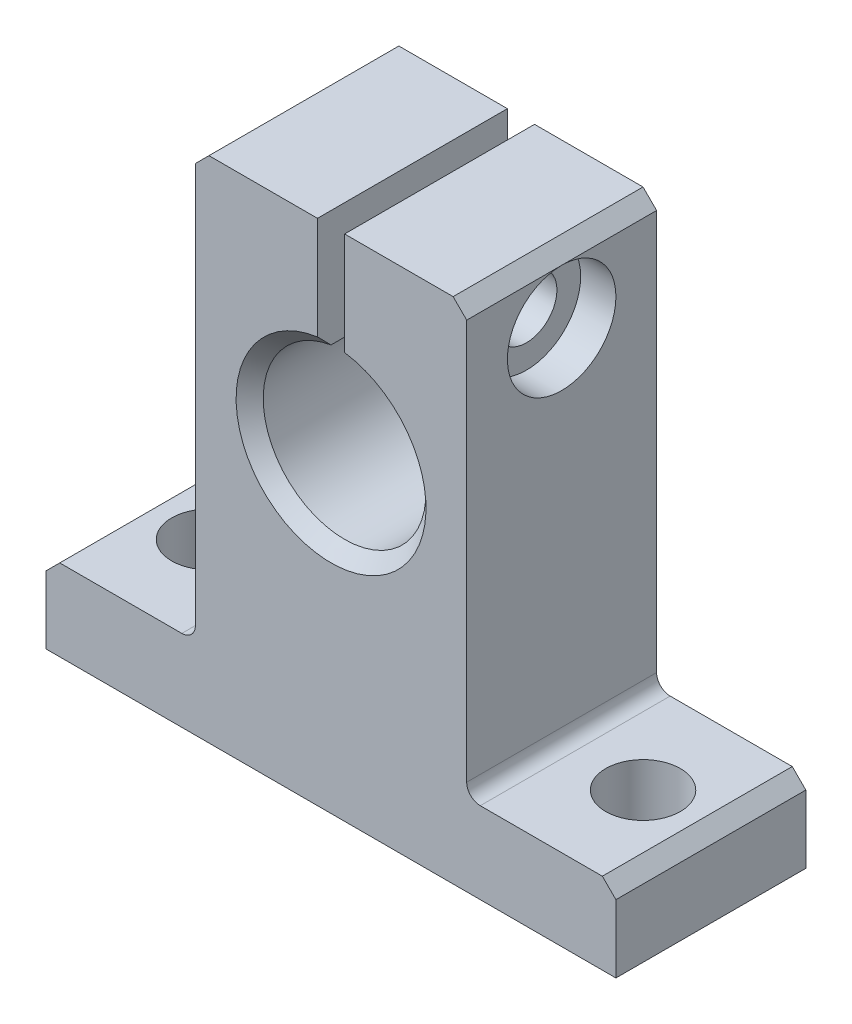
ISO-10303-21;
HEADER;
FILE_DESCRIPTION(('STEP AP214'),'2;1');
FILE_NAME('part.step','',(''),(''),'','','');
FILE_SCHEMA(('AUTOMOTIVE_DESIGN { 1 0 10303 214 1 1 1 1 }'));
ENDSEC;
DATA;
#1=APPLICATION_CONTEXT('core data for automotive mechanical design processes');
#2=APPLICATION_PROTOCOL_DEFINITION('international standard','automotive_design',2000,#1);
#3=PRODUCT_CONTEXT('',#1,'mechanical');
#4=PRODUCT('Part','Part','',(#3));
#5=PRODUCT_RELATED_PRODUCT_CATEGORY('part','',(#4));
#6=PRODUCT_DEFINITION_FORMATION('','',#4);
#7=PRODUCT_DEFINITION_CONTEXT('part definition',#1,'design');
#8=PRODUCT_DEFINITION('design','',#6,#7);
#9=PRODUCT_DEFINITION_SHAPE('','',#8);
#10=(LENGTH_UNIT() NAMED_UNIT(*) SI_UNIT(.MILLI.,.METRE.));
#11=(NAMED_UNIT(*) PLANE_ANGLE_UNIT() SI_UNIT($,.RADIAN.));
#12=(NAMED_UNIT(*) SI_UNIT($,.STERADIAN.) SOLID_ANGLE_UNIT());
#13=UNCERTAINTY_MEASURE_WITH_UNIT(LENGTH_MEASURE(1.E-05),#10,'distance_accuracy_value','');
#14=(GEOMETRIC_REPRESENTATION_CONTEXT(3) GLOBAL_UNCERTAINTY_ASSIGNED_CONTEXT((#13)) GLOBAL_UNIT_ASSIGNED_CONTEXT((#10,
#11,#12)) REPRESENTATION_CONTEXT('',''));
#15=CARTESIAN_POINT('',(0.,0.,0.));
#16=DIRECTION('',(0.,0.,1.));
#17=DIRECTION('',(1.,0.,0.));
#18=AXIS2_PLACEMENT_3D('',#15,#16,#17);
#19=CARTESIAN_POINT('',(0.,23.,14.));
#20=DIRECTION('',(0.,0.,-1.));
#21=DIRECTION('',(-1.,0.,0.));
#22=AXIS2_PLACEMENT_3D('',#19,#20,#21);
#23=CYLINDRICAL_SURFACE('',#22,6.);
#24=DIRECTION('',(0.,0.,-1.));
#25=VECTOR('',#24,1.);
#26=CARTESIAN_POINT('',(0.999999999999999,28.9160797830996,14.));
#27=LINE('',#26,#25);
#28=CARTESIAN_POINT('',(0.999999999999999,28.9160797830996,13.));
#29=VERTEX_POINT('',#28);
#30=CARTESIAN_POINT('',(0.999999999999999,28.9160797830996,1.00000000000002));
#31=VERTEX_POINT('',#30);
#32=EDGE_CURVE('E228',#29,#31,#27,.T.);
#33=ORIENTED_EDGE('',*,*,#32,.T.);
#34=CARTESIAN_POINT('',(0.,23.,1.00000000000002));
#35=DIRECTION('',(0.,0.,1.));
#36=DIRECTION('',(1.,0.,0.));
#37=AXIS2_PLACEMENT_3D('',#34,#35,#36);
#38=CIRCLE('',#37,6.);
#39=CARTESIAN_POINT('',(-0.999999999999999,28.9160797830996,1.00000000000002));
#40=VERTEX_POINT('',#39);
#41=EDGE_CURVE('E315',#31,#40,#38,.F.);
#42=ORIENTED_EDGE('',*,*,#41,.T.);
#43=DIRECTION('',(0.,0.,-1.));
#44=VECTOR('',#43,1.);
#45=CARTESIAN_POINT('',(-0.999999999999999,28.9160797830996,14.));
#46=LINE('',#45,#44);
#47=CARTESIAN_POINT('',(-0.999999999999999,28.9160797830996,13.));
#48=VERTEX_POINT('',#47);
#49=EDGE_CURVE('E199',#48,#40,#46,.T.);
#50=ORIENTED_EDGE('',*,*,#49,.F.);
#51=CARTESIAN_POINT('',(0.,23.,13.));
#52=DIRECTION('',(0.,0.,1.));
#53=DIRECTION('',(1.,0.,0.));
#54=AXIS2_PLACEMENT_3D('',#51,#52,#53);
#55=CIRCLE('',#54,6.);
#56=EDGE_CURVE('E313',#48,#29,#55,.T.);
#57=ORIENTED_EDGE('',*,*,#56,.T.);
#58=EDGE_LOOP('',(#33,#42,#50,#57));
#59=FACE_BOUND('',#58,.T.);
#60=ADVANCED_FACE('F33',(#59),#23,.F.);
#61=CARTESIAN_POINT('',(-0.999999999999999,37.5,14.));
#62=DIRECTION('',(-1.,0.,0.));
#63=DIRECTION('',(0.,0.,1.));
#64=AXIS2_PLACEMENT_3D('',#61,#62,#63);
#65=PLANE('',#64);
#66=CARTESIAN_POINT('',(-1.,32.5,7.));
#67=DIRECTION('',(1.,0.,0.));
#68=DIRECTION('',(0.,0.,-1.));
#69=AXIS2_PLACEMENT_3D('',#66,#67,#68);
#70=CIRCLE('',#69,2.025);
#71=CARTESIAN_POINT('',(-1.,32.5,4.975));
#72=VERTEX_POINT('',#71);
#73=EDGE_CURVE('E707',#72,#72,#70,.T.);
#74=ORIENTED_EDGE('',*,*,#73,.F.);
#75=EDGE_LOOP('',(#74));
#76=FACE_BOUND('',#75,.T.);
#77=ORIENTED_EDGE('',*,*,#49,.T.);
#78=CARTESIAN_POINT('',(-0.999999999999999,28.9160797830996,1.00000000000002));
#79=CARTESIAN_POINT('',(-0.999999999999999,29.0849233868446,0.833491585824262));
#80=CARTESIAN_POINT('',(-0.999999999999999,29.2536888107414,0.666904043991124));
#81=CARTESIAN_POINT('',(-0.999999999999999,29.5910632931281,0.333570710652427));
#82=CARTESIAN_POINT('',(-0.999999999999999,29.7596723516232,0.166824919152224));
#83=CARTESIAN_POINT('',(-0.999999999999999,29.9282032302755,0.));
#84=B_SPLINE_CURVE_WITH_KNOTS('',3,(#78,#79,#80,#81,#82,#83),.UNSPECIFIED.,.F.,.F.,(4,2,4),(0.,
0.711406070099036,1.42281211611413),.UNSPECIFIED.);
#85=CARTESIAN_POINT('',(-0.999999999999999,29.9282032302755,0.));
#86=VERTEX_POINT('',#85);
#87=EDGE_CURVE('E325',#40,#86,#84,.T.);
#88=ORIENTED_EDGE('',*,*,#87,.T.);
#89=DIRECTION('',(0.,1.,0.));
#90=VECTOR('',#89,1.);
#91=CARTESIAN_POINT('',(-0.999999999999999,37.5,0.));
#92=LINE('',#91,#90);
#93=CARTESIAN_POINT('',(-0.999999999999999,37.5,0.));
#94=VERTEX_POINT('',#93);
#95=EDGE_CURVE('E195',#86,#94,#92,.T.);
#96=ORIENTED_EDGE('',*,*,#95,.T.);
#97=DIRECTION('',(0.,0.,-1.));
#98=VECTOR('',#97,1.);
#99=CARTESIAN_POINT('',(-0.999999999999999,37.5,14.));
#100=LINE('',#99,#98);
#101=CARTESIAN_POINT('',(-0.999999999999999,37.5,14.));
#102=VERTEX_POINT('',#101);
#103=EDGE_CURVE('E191',#102,#94,#100,.T.);
#104=ORIENTED_EDGE('',*,*,#103,.F.);
#105=DIRECTION('',(0.,1.,0.));
#106=VECTOR('',#105,1.);
#107=CARTESIAN_POINT('',(-0.999999999999999,37.5,14.));
#108=LINE('',#107,#106);
#109=CARTESIAN_POINT('',(-0.999999999999999,29.9282032302755,14.));
#110=VERTEX_POINT('',#109);
#111=EDGE_CURVE('E177',#110,#102,#108,.T.);
#112=ORIENTED_EDGE('',*,*,#111,.F.);
#113=CARTESIAN_POINT('',(-0.999999999999999,29.9282032302755,14.));
#114=CARTESIAN_POINT('',(-0.999999999999999,29.7596723516232,13.8331750808478));
#115=CARTESIAN_POINT('',(-0.999999999999999,29.5910632931281,13.6664292893476));
#116=CARTESIAN_POINT('',(-0.999999999999999,29.2536888107414,13.3330959560089));
#117=CARTESIAN_POINT('',(-0.999999999999999,29.0849233868446,13.1665084141758));
#118=CARTESIAN_POINT('',(-0.999999999999999,28.9160797830996,13.));
#119=B_SPLINE_CURVE_WITH_KNOTS('',3,(#113,#114,#115,#116,#117,#118),.UNSPECIFIED.,.F.,.F.,(4,2,
4),(0.,0.711406046015081,1.4228121161141),.UNSPECIFIED.);
#120=EDGE_CURVE('E318',#110,#48,#119,.T.);
#121=ORIENTED_EDGE('',*,*,#120,.T.);
#122=EDGE_LOOP('',(#77,#88,#96,#104,#112,#121));
#123=FACE_BOUND('',#122,.T.);
#124=ADVANCED_FACE('F193',(#76,#123),#65,.F.);
#125=CARTESIAN_POINT('',(-10.,37.5,14.));
#126=DIRECTION('',(0.,-1.,0.));
#127=DIRECTION('',(0.,0.,-1.));
#128=AXIS2_PLACEMENT_3D('',#125,#126,#127);
#129=PLANE('',#128);
#130=DIRECTION('',(-1.,0.,0.));
#131=VECTOR('',#130,1.);
#132=CARTESIAN_POINT('',(-10.,37.5,0.));
#133=LINE('',#132,#131);
#134=CARTESIAN_POINT('',(-9.,37.5,0.));
#135=VERTEX_POINT('',#134);
#136=EDGE_CURVE('E230',#94,#135,#133,.T.);
#137=ORIENTED_EDGE('',*,*,#136,.T.);
#138=DIRECTION('',(0.,0.,1.));
#139=VECTOR('',#138,1.);
#140=CARTESIAN_POINT('',(-9.,37.5,14.));
#141=LINE('',#140,#139);
#142=CARTESIAN_POINT('',(-8.99999999999999,37.5,14.));
#143=VERTEX_POINT('',#142);
#144=EDGE_CURVE('E204',#135,#143,#141,.T.);
#145=ORIENTED_EDGE('',*,*,#144,.T.);
#146=DIRECTION('',(-1.,0.,0.));
#147=VECTOR('',#146,1.);
#148=CARTESIAN_POINT('',(-10.,37.5,14.));
#149=LINE('',#148,#147);
#150=EDGE_CURVE('E182',#102,#143,#149,.T.);
#151=ORIENTED_EDGE('',*,*,#150,.F.);
#152=ORIENTED_EDGE('',*,*,#103,.T.);
#153=EDGE_LOOP('',(#137,#145,#151,#152));
#154=FACE_BOUND('',#153,.T.);
#155=ADVANCED_FACE('F202',(#154),#129,.F.);
#156=CARTESIAN_POINT('',(-10.,5.99999999999999,14.));
#157=DIRECTION('',(1.,0.,0.));
#158=DIRECTION('',(0.,0.,-1.));
#159=AXIS2_PLACEMENT_3D('',#156,#157,#158);
#160=PLANE('',#159);
#161=CARTESIAN_POINT('',(-10.,32.5,7.));
#162=DIRECTION('',(1.,0.,0.));
#163=DIRECTION('',(0.,0.,-1.));
#164=AXIS2_PLACEMENT_3D('',#161,#162,#163);
#165=CIRCLE('',#164,1.65);
#166=CARTESIAN_POINT('',(-10.,32.5,5.35));
#167=VERTEX_POINT('',#166);
#168=EDGE_CURVE('E263',#167,#167,#165,.T.);
#169=ORIENTED_EDGE('',*,*,#168,.T.);
#170=EDGE_LOOP('',(#169));
#171=FACE_BOUND('',#170,.T.);
#172=DIRECTION('',(0.,-1.,0.));
#173=VECTOR('',#172,1.);
#174=CARTESIAN_POINT('',(-10.,5.99999999999999,14.));
#175=LINE('',#174,#173);
#176=CARTESIAN_POINT('',(-10.,36.5,14.));
#177=VERTEX_POINT('',#176);
#178=CARTESIAN_POINT('',(-10.,6.99999999999999,14.));
#179=VERTEX_POINT('',#178);
#180=EDGE_CURVE('E205',#177,#179,#175,.T.);
#181=ORIENTED_EDGE('',*,*,#180,.F.);
#182=DIRECTION('',(0.,0.,-1.));
#183=VECTOR('',#182,1.);
#184=CARTESIAN_POINT('',(-10.,36.5,14.));
#185=LINE('',#184,#183);
#186=CARTESIAN_POINT('',(-10.,36.5,0.));
#187=VERTEX_POINT('',#186);
#188=EDGE_CURVE('E367',#177,#187,#185,.T.);
#189=ORIENTED_EDGE('',*,*,#188,.T.);
#190=DIRECTION('',(0.,-1.,0.));
#191=VECTOR('',#190,1.);
#192=CARTESIAN_POINT('',(-10.,5.99999999999999,0.));
#193=LINE('',#192,#191);
#194=CARTESIAN_POINT('',(-10.,6.99999999999999,0.));
#195=VERTEX_POINT('',#194);
#196=EDGE_CURVE('E233',#187,#195,#193,.T.);
#197=ORIENTED_EDGE('',*,*,#196,.T.);
#198=DIRECTION('',(0.,0.,-1.));
#199=VECTOR('',#198,1.);
#200=CARTESIAN_POINT('',(-10.,6.99999999999999,14.));
#201=LINE('',#200,#199);
#202=EDGE_CURVE('E270',#195,#179,#201,.F.);
#203=ORIENTED_EDGE('',*,*,#202,.T.);
#204=EDGE_LOOP('',(#181,#189,#197,#203));
#205=FACE_BOUND('',#204,.T.);
#206=ADVANCED_FACE('F407',(#171,#205),#160,.F.);
#207=CARTESIAN_POINT('',(-21.,5.99999999999999,14.));
#208=DIRECTION('',(0.,-1.,0.));
#209=DIRECTION('',(0.,0.,-1.));
#210=AXIS2_PLACEMENT_3D('',#207,#208,#209);
#211=PLANE('',#210);
#212=CARTESIAN_POINT('',(-16.,5.99999999999999,7.));
#213=DIRECTION('',(0.,1.,0.));
#214=DIRECTION('',(0.,0.,1.));
#215=AXIS2_PLACEMENT_3D('',#212,#213,#214);
#216=CIRCLE('',#215,2.75);
#217=CARTESIAN_POINT('',(-16.,5.99999999999999,9.75));
#218=VERTEX_POINT('',#217);
#219=EDGE_CURVE('E690',#218,#218,#216,.T.);
#220=ORIENTED_EDGE('',*,*,#219,.F.);
#221=EDGE_LOOP('',(#220));
#222=FACE_BOUND('',#221,.T.);
#223=DIRECTION('',(-1.,0.,0.));
#224=VECTOR('',#223,1.);
#225=CARTESIAN_POINT('',(-21.,5.99999999999999,0.));
#226=LINE('',#225,#224);
#227=CARTESIAN_POINT('',(-11.,5.99999999999999,0.));
#228=VERTEX_POINT('',#227);
#229=CARTESIAN_POINT('',(-20.,5.99999999999999,0.));
#230=VERTEX_POINT('',#229);
#231=EDGE_CURVE('E235',#228,#230,#226,.T.);
#232=ORIENTED_EDGE('',*,*,#231,.T.);
#233=DIRECTION('',(0.,0.,1.));
#234=VECTOR('',#233,1.);
#235=CARTESIAN_POINT('',(-20.,5.99999999999999,14.));
#236=LINE('',#235,#234);
#237=CARTESIAN_POINT('',(-20.,5.99999999999999,14.));
#238=VERTEX_POINT('',#237);
#239=EDGE_CURVE('E302',#230,#238,#236,.T.);
#240=ORIENTED_EDGE('',*,*,#239,.T.);
#241=DIRECTION('',(-1.,0.,0.));
#242=VECTOR('',#241,1.);
#243=CARTESIAN_POINT('',(-21.,5.99999999999999,14.));
#244=LINE('',#243,#242);
#245=CARTESIAN_POINT('',(-11.,5.99999999999999,14.));
#246=VERTEX_POINT('',#245);
#247=EDGE_CURVE('E207',#246,#238,#244,.T.);
#248=ORIENTED_EDGE('',*,*,#247,.F.);
#249=DIRECTION('',(0.,0.,-1.));
#250=VECTOR('',#249,1.);
#251=CARTESIAN_POINT('',(-11.,5.99999999999999,0.));
#252=LINE('',#251,#250);
#253=EDGE_CURVE('E262',#246,#228,#252,.T.);
#254=ORIENTED_EDGE('',*,*,#253,.T.);
#255=EDGE_LOOP('',(#232,#240,#248,#254));
#256=FACE_BOUND('',#255,.T.);
#257=ADVANCED_FACE('F404',(#222,#256),#211,.F.);
#258=CARTESIAN_POINT('',(-21.,0.,14.));
#259=DIRECTION('',(1.,0.,0.));
#260=DIRECTION('',(0.,0.,-1.));
#261=AXIS2_PLACEMENT_3D('',#258,#259,#260);
#262=PLANE('',#261);
#263=DIRECTION('',(0.,-1.,0.));
#264=VECTOR('',#263,1.);
#265=CARTESIAN_POINT('',(-21.,0.,14.));
#266=LINE('',#265,#264);
#267=CARTESIAN_POINT('',(-21.,5.,14.));
#268=VERTEX_POINT('',#267);
#269=CARTESIAN_POINT('',(-21.,0.,14.));
#270=VERTEX_POINT('',#269);
#271=EDGE_CURVE('E212',#268,#270,#266,.T.);
#272=ORIENTED_EDGE('',*,*,#271,.F.);
#273=DIRECTION('',(0.,0.,-1.));
#274=VECTOR('',#273,1.);
#275=CARTESIAN_POINT('',(-21.,5.,14.));
#276=LINE('',#275,#274);
#277=CARTESIAN_POINT('',(-21.,5.,0.));
#278=VERTEX_POINT('',#277);
#279=EDGE_CURVE('E289',#268,#278,#276,.T.);
#280=ORIENTED_EDGE('',*,*,#279,.T.);
#281=DIRECTION('',(0.,-1.,0.));
#282=VECTOR('',#281,1.);
#283=CARTESIAN_POINT('',(-21.,0.,0.));
#284=LINE('',#283,#282);
#285=CARTESIAN_POINT('',(-21.,0.,0.));
#286=VERTEX_POINT('',#285);
#287=EDGE_CURVE('E238',#278,#286,#284,.T.);
#288=ORIENTED_EDGE('',*,*,#287,.T.);
#289=DIRECTION('',(0.,0.,-1.));
#290=VECTOR('',#289,1.);
#291=CARTESIAN_POINT('',(-21.,0.,14.));
#292=LINE('',#291,#290);
#293=EDGE_CURVE('E200',#270,#286,#292,.T.);
#294=ORIENTED_EDGE('',*,*,#293,.F.);
#295=EDGE_LOOP('',(#272,#280,#288,#294));
#296=FACE_BOUND('',#295,.T.);
#297=ADVANCED_FACE('F400',(#296),#262,.F.);
#298=CARTESIAN_POINT('',(21.,0.,14.));
#299=DIRECTION('',(0.,1.,0.));
#300=DIRECTION('',(0.,0.,1.));
#301=AXIS2_PLACEMENT_3D('',#298,#299,#300);
#302=PLANE('',#301);
#303=CARTESIAN_POINT('',(-16.,0.,7.));
#304=DIRECTION('',(0.,1.,0.));
#305=DIRECTION('',(0.,0.,1.));
#306=AXIS2_PLACEMENT_3D('',#303,#304,#305);
#307=CIRCLE('',#306,2.75);
#308=CARTESIAN_POINT('',(-16.,0.,9.75));
#309=VERTEX_POINT('',#308);
#310=EDGE_CURVE('E687',#309,#309,#307,.T.);
#311=ORIENTED_EDGE('',*,*,#310,.T.);
#312=EDGE_LOOP('',(#311));
#313=FACE_BOUND('',#312,.T.);
#314=CARTESIAN_POINT('',(16.,0.,7.));
#315=DIRECTION('',(0.,1.,0.));
#316=DIRECTION('',(0.,0.,1.));
#317=AXIS2_PLACEMENT_3D('',#314,#315,#316);
#318=CIRCLE('',#317,2.75);
#319=CARTESIAN_POINT('',(16.,0.,9.75));
#320=VERTEX_POINT('',#319);
#321=EDGE_CURVE('E231',#320,#320,#318,.T.);
#322=ORIENTED_EDGE('',*,*,#321,.T.);
#323=EDGE_LOOP('',(#322));
#324=FACE_BOUND('',#323,.T.);
#325=DIRECTION('',(1.,0.,0.));
#326=VECTOR('',#325,1.);
#327=CARTESIAN_POINT('',(21.,0.,0.));
#328=LINE('',#327,#326);
#329=CARTESIAN_POINT('',(21.,0.,0.));
#330=VERTEX_POINT('',#329);
#331=EDGE_CURVE('E240',#286,#330,#328,.T.);
#332=ORIENTED_EDGE('',*,*,#331,.T.);
#333=DIRECTION('',(0.,0.,-1.));
#334=VECTOR('',#333,1.);
#335=CARTESIAN_POINT('',(21.,0.,14.));
#336=LINE('',#335,#334);
#337=CARTESIAN_POINT('',(21.,0.,14.));
#338=VERTEX_POINT('',#337);
#339=EDGE_CURVE('E256',#338,#330,#336,.T.);
#340=ORIENTED_EDGE('',*,*,#339,.F.);
#341=DIRECTION('',(1.,0.,0.));
#342=VECTOR('',#341,1.);
#343=CARTESIAN_POINT('',(21.,0.,14.));
#344=LINE('',#343,#342);
#345=EDGE_CURVE('E214',#270,#338,#344,.T.);
#346=ORIENTED_EDGE('',*,*,#345,.F.);
#347=ORIENTED_EDGE('',*,*,#293,.T.);
#348=EDGE_LOOP('',(#332,#340,#346,#347));
#349=FACE_BOUND('',#348,.T.);
#350=ADVANCED_FACE('F396',(#313,#324,#349),#302,.F.);
#351=CARTESIAN_POINT('',(21.,0.,14.));
#352=DIRECTION('',(-1.,0.,0.));
#353=DIRECTION('',(0.,0.,1.));
#354=AXIS2_PLACEMENT_3D('',#351,#352,#353);
#355=PLANE('',#354);
#356=DIRECTION('',(0.,1.,0.));
#357=VECTOR('',#356,1.);
#358=CARTESIAN_POINT('',(21.,0.,0.));
#359=LINE('',#358,#357);
#360=CARTESIAN_POINT('',(21.,5.,0.));
#361=VERTEX_POINT('',#360);
#362=EDGE_CURVE('E242',#330,#361,#359,.T.);
#363=ORIENTED_EDGE('',*,*,#362,.T.);
#364=DIRECTION('',(0.,0.,1.));
#365=VECTOR('',#364,1.);
#366=CARTESIAN_POINT('',(21.,5.,14.));
#367=LINE('',#366,#365);
#368=CARTESIAN_POINT('',(21.,5.,14.));
#369=VERTEX_POINT('',#368);
#370=EDGE_CURVE('E11',#361,#369,#367,.T.);
#371=ORIENTED_EDGE('',*,*,#370,.T.);
#372=DIRECTION('',(0.,1.,0.));
#373=VECTOR('',#372,1.);
#374=CARTESIAN_POINT('',(21.,0.,14.));
#375=LINE('',#374,#373);
#376=EDGE_CURVE('E216',#338,#369,#375,.T.);
#377=ORIENTED_EDGE('',*,*,#376,.F.);
#378=ORIENTED_EDGE('',*,*,#339,.T.);
#379=EDGE_LOOP('',(#363,#371,#377,#378));
#380=FACE_BOUND('',#379,.T.);
#381=ADVANCED_FACE('F392',(#380),#355,.F.);
#382=CARTESIAN_POINT('',(21.,5.99999999999999,14.));
#383=DIRECTION('',(0.,-1.,0.));
#384=DIRECTION('',(0.,0.,-1.));
#385=AXIS2_PLACEMENT_3D('',#382,#383,#384);
#386=PLANE('',#385);
#387=CARTESIAN_POINT('',(16.,5.99999999999999,7.));
#388=DIRECTION('',(0.,1.,0.));
#389=DIRECTION('',(0.,0.,1.));
#390=AXIS2_PLACEMENT_3D('',#387,#388,#389);
#391=CIRCLE('',#390,2.75);
#392=CARTESIAN_POINT('',(16.,5.99999999999999,9.75));
#393=VERTEX_POINT('',#392);
#394=EDGE_CURVE('E686',#393,#393,#391,.T.);
#395=ORIENTED_EDGE('',*,*,#394,.F.);
#396=EDGE_LOOP('',(#395));
#397=FACE_BOUND('',#396,.T.);
#398=DIRECTION('',(-1.,0.,0.));
#399=VECTOR('',#398,1.);
#400=CARTESIAN_POINT('',(21.,5.99999999999999,14.));
#401=LINE('',#400,#399);
#402=CARTESIAN_POINT('',(20.,5.99999999999999,14.));
#403=VERTEX_POINT('',#402);
#404=CARTESIAN_POINT('',(11.,5.99999999999999,14.));
#405=VERTEX_POINT('',#404);
#406=EDGE_CURVE('E219',#403,#405,#401,.T.);
#407=ORIENTED_EDGE('',*,*,#406,.F.);
#408=DIRECTION('',(0.,0.,-1.));
#409=VECTOR('',#408,1.);
#410=CARTESIAN_POINT('',(20.,5.99999999999999,14.));
#411=LINE('',#410,#409);
#412=CARTESIAN_POINT('',(20.,5.99999999999999,0.));
#413=VERTEX_POINT('',#412);
#414=EDGE_CURVE('E41',#403,#413,#411,.T.);
#415=ORIENTED_EDGE('',*,*,#414,.T.);
#416=DIRECTION('',(-1.,0.,0.));
#417=VECTOR('',#416,1.);
#418=CARTESIAN_POINT('',(21.,5.99999999999999,0.));
#419=LINE('',#418,#417);
#420=CARTESIAN_POINT('',(11.,5.99999999999999,0.));
#421=VERTEX_POINT('',#420);
#422=EDGE_CURVE('E245',#413,#421,#419,.T.);
#423=ORIENTED_EDGE('',*,*,#422,.T.);
#424=DIRECTION('',(0.,0.,-1.));
#425=VECTOR('',#424,1.);
#426=CARTESIAN_POINT('',(11.,5.99999999999999,14.));
#427=LINE('',#426,#425);
#428=EDGE_CURVE('E276',#421,#405,#427,.F.);
#429=ORIENTED_EDGE('',*,*,#428,.T.);
#430=EDGE_LOOP('',(#407,#415,#423,#429));
#431=FACE_BOUND('',#430,.T.);
#432=ADVANCED_FACE('F389',(#397,#431),#386,.F.);
#433=CARTESIAN_POINT('',(10.,5.99999999999999,14.));
#434=DIRECTION('',(-1.,0.,0.));
#435=DIRECTION('',(0.,0.,1.));
#436=AXIS2_PLACEMENT_3D('',#433,#434,#435);
#437=PLANE('',#436);
#438=DIRECTION('',(0.,1.,0.));
#439=VECTOR('',#438,1.);
#440=CARTESIAN_POINT('',(10.,5.99999999999999,0.));
#441=LINE('',#440,#439);
#442=CARTESIAN_POINT('',(10.,6.99999999999999,0.));
#443=VERTEX_POINT('',#442);
#444=CARTESIAN_POINT('',(10.,36.5,0.));
#445=VERTEX_POINT('',#444);
#446=EDGE_CURVE('E247',#443,#445,#441,.T.);
#447=ORIENTED_EDGE('',*,*,#446,.T.);
#448=DIRECTION('',(0.,0.,1.));
#449=VECTOR('',#448,1.);
#450=CARTESIAN_POINT('',(10.,36.5,14.));
#451=LINE('',#450,#449);
#452=CARTESIAN_POINT('',(10.,36.5,7.));
#453=VERTEX_POINT('',#452);
#454=EDGE_CURVE('E48',#445,#453,#451,.T.);
#455=ORIENTED_EDGE('',*,*,#454,.T.);
#456=CARTESIAN_POINT('',(10.,32.5,7.));
#457=DIRECTION('',(1.,0.,0.));
#458=DIRECTION('',(0.,0.,-1.));
#459=AXIS2_PLACEMENT_3D('',#456,#457,#458);
#460=CIRCLE('',#459,4.);
#461=EDGE_CURVE('E266',#453,#453,#460,.T.);
#462=ORIENTED_EDGE('',*,*,#461,.F.);
#463=DIRECTION('',(0.,0.,1.));
#464=VECTOR('',#463,1.);
#465=CARTESIAN_POINT('',(10.,36.5,14.));
#466=LINE('',#465,#464);
#467=CARTESIAN_POINT('',(10.,36.5,14.));
#468=VERTEX_POINT('',#467);
#469=EDGE_CURVE('E426',#453,#468,#466,.T.);
#470=ORIENTED_EDGE('',*,*,#469,.T.);
#471=DIRECTION('',(0.,1.,0.));
#472=VECTOR('',#471,1.);
#473=CARTESIAN_POINT('',(10.,5.99999999999999,14.));
#474=LINE('',#473,#472);
#475=CARTESIAN_POINT('',(10.,6.99999999999999,14.));
#476=VERTEX_POINT('',#475);
#477=EDGE_CURVE('E221',#476,#468,#474,.T.);
#478=ORIENTED_EDGE('',*,*,#477,.F.);
#479=DIRECTION('',(0.,0.,-1.));
#480=VECTOR('',#479,1.);
#481=CARTESIAN_POINT('',(10.,6.99999999999999,0.));
#482=LINE('',#481,#480);
#483=EDGE_CURVE('E273',#476,#443,#482,.T.);
#484=ORIENTED_EDGE('',*,*,#483,.T.);
#485=EDGE_LOOP('',(#447,#455,#462,#470,#478,#484));
#486=FACE_BOUND('',#485,.T.);
#487=ADVANCED_FACE('F385',(#486),#437,.F.);
#488=CARTESIAN_POINT('',(10.,37.5,14.));
#489=DIRECTION('',(0.,-1.,0.));
#490=DIRECTION('',(0.,0.,-1.));
#491=AXIS2_PLACEMENT_3D('',#488,#489,#490);
#492=PLANE('',#491);
#493=DIRECTION('',(-1.,0.,0.));
#494=VECTOR('',#493,1.);
#495=CARTESIAN_POINT('',(10.,37.5,14.));
#496=LINE('',#495,#494);
#497=CARTESIAN_POINT('',(9.,37.5,14.));
#498=VERTEX_POINT('',#497);
#499=CARTESIAN_POINT('',(0.999999999999999,37.5,14.));
#500=VERTEX_POINT('',#499);
#501=EDGE_CURVE('E224',#498,#500,#496,.T.);
#502=ORIENTED_EDGE('',*,*,#501,.F.);
#503=DIRECTION('',(0.,0.,-1.));
#504=VECTOR('',#503,1.);
#505=CARTESIAN_POINT('',(9.,37.5,14.));
#506=LINE('',#505,#504);
#507=CARTESIAN_POINT('',(9.,37.5,0.));
#508=VERTEX_POINT('',#507);
#509=EDGE_CURVE('E424',#498,#508,#506,.T.);
#510=ORIENTED_EDGE('',*,*,#509,.T.);
#511=DIRECTION('',(-1.,0.,0.));
#512=VECTOR('',#511,1.);
#513=CARTESIAN_POINT('',(10.,37.5,0.));
#514=LINE('',#513,#512);
#515=CARTESIAN_POINT('',(0.999999999999999,37.5,0.));
#516=VERTEX_POINT('',#515);
#517=EDGE_CURVE('E249',#508,#516,#514,.T.);
#518=ORIENTED_EDGE('',*,*,#517,.T.);
#519=DIRECTION('',(0.,0.,-1.));
#520=VECTOR('',#519,1.);
#521=CARTESIAN_POINT('',(0.999999999999999,37.5,14.));
#522=LINE('',#521,#520);
#523=EDGE_CURVE('E253',#500,#516,#522,.T.);
#524=ORIENTED_EDGE('',*,*,#523,.F.);
#525=EDGE_LOOP('',(#502,#510,#518,#524));
#526=FACE_BOUND('',#525,.T.);
#527=ADVANCED_FACE('F378',(#526),#492,.F.);
#528=CARTESIAN_POINT('',(0.999999999999999,37.5,14.));
#529=DIRECTION('',(1.,0.,0.));
#530=DIRECTION('',(0.,0.,-1.));
#531=AXIS2_PLACEMENT_3D('',#528,#529,#530);
#532=PLANE('',#531);
#533=CARTESIAN_POINT('',(0.999999999999999,32.5,7.));
#534=DIRECTION('',(1.,0.,0.));
#535=DIRECTION('',(0.,0.,-1.));
#536=AXIS2_PLACEMENT_3D('',#533,#534,#535);
#537=CIRCLE('',#536,2.25);
#538=CARTESIAN_POINT('',(0.999999999999999,32.5,4.75));
#539=VERTEX_POINT('',#538);
#540=EDGE_CURVE('E695',#539,#539,#537,.T.);
#541=ORIENTED_EDGE('',*,*,#540,.T.);
#542=EDGE_LOOP('',(#541));
#543=FACE_BOUND('',#542,.T.);
#544=DIRECTION('',(0.,-1.,0.));
#545=VECTOR('',#544,1.);
#546=CARTESIAN_POINT('',(0.999999999999999,37.5,0.));
#547=LINE('',#546,#545);
#548=CARTESIAN_POINT('',(0.999999999999999,29.9282032302755,0.));
#549=VERTEX_POINT('',#548);
#550=EDGE_CURVE('E188',#516,#549,#547,.T.);
#551=ORIENTED_EDGE('',*,*,#550,.T.);
#552=CARTESIAN_POINT('',(0.999999999999999,29.9282032302755,0.));
#553=CARTESIAN_POINT('',(0.999999999999999,29.7596723516232,0.166824919152224));
#554=CARTESIAN_POINT('',(0.999999999999999,29.5910632931281,0.333570710652427));
#555=CARTESIAN_POINT('',(0.999999999999999,29.2536888107414,0.666904043991124));
#556=CARTESIAN_POINT('',(0.999999999999999,29.0849233868446,0.833491585824261));
#557=CARTESIAN_POINT('',(0.999999999999999,28.9160797830996,1.00000000000002));
#558=B_SPLINE_CURVE_WITH_KNOTS('',3,(#552,#553,#554,#555,#556,#557),.UNSPECIFIED.,.F.,.F.,(4,2,
4),(0.,0.711406046015096,1.42281211611413),.UNSPECIFIED.);
#559=EDGE_CURVE('E56',#549,#31,#558,.T.);
#560=ORIENTED_EDGE('',*,*,#559,.T.);
#561=ORIENTED_EDGE('',*,*,#32,.F.);
#562=CARTESIAN_POINT('',(0.999999999999999,28.9160797830996,13.));
#563=CARTESIAN_POINT('',(0.999999999999999,29.0849233868446,13.1665084141758));
#564=CARTESIAN_POINT('',(0.999999999999999,29.2536888107414,13.3330959560089));
#565=CARTESIAN_POINT('',(0.999999999999999,29.5910632931281,13.6664292893476));
#566=CARTESIAN_POINT('',(0.999999999999999,29.7596723516232,13.8331750808478));
#567=CARTESIAN_POINT('',(0.999999999999999,29.9282032302755,14.));
#568=B_SPLINE_CURVE_WITH_KNOTS('',3,(#562,#563,#564,#565,#566,#567),.UNSPECIFIED.,.F.,.F.,(4,2,
4),(0.,0.71140607009902,1.4228121161141),.UNSPECIFIED.);
#569=CARTESIAN_POINT('',(0.999999999999999,29.9282032302755,14.));
#570=VERTEX_POINT('',#569);
#571=EDGE_CURVE('E368',#29,#570,#568,.T.);
#572=ORIENTED_EDGE('',*,*,#571,.T.);
#573=DIRECTION('',(0.,-1.,0.));
#574=VECTOR('',#573,1.);
#575=CARTESIAN_POINT('',(0.999999999999999,37.5,14.));
#576=LINE('',#575,#574);
#577=EDGE_CURVE('E226',#500,#570,#576,.T.);
#578=ORIENTED_EDGE('',*,*,#577,.F.);
#579=ORIENTED_EDGE('',*,*,#523,.T.);
#580=EDGE_LOOP('',(#551,#560,#561,#572,#578,#579));
#581=FACE_BOUND('',#580,.T.);
#582=ADVANCED_FACE('F373',(#543,#581),#532,.F.);
#583=CARTESIAN_POINT('',(0.,23.,14.));
#584=DIRECTION('',(0.,0.,1.));
#585=DIRECTION('',(1.,0.,0.));
#586=AXIS2_PLACEMENT_3D('',#583,#584,#585);
#587=PLANE('',#586);
#588=ORIENTED_EDGE('',*,*,#247,.T.);
#589=DIRECTION('',(0.707106781186548,0.707106781186548,0.));
#590=VECTOR('',#589,1.);
#591=CARTESIAN_POINT('',(-1.5,24.5,14.));
#592=LINE('',#591,#590);
#593=EDGE_CURVE('E311',#238,#268,#592,.F.);
#594=ORIENTED_EDGE('',*,*,#593,.T.);
#595=ORIENTED_EDGE('',*,*,#271,.T.);
#596=ORIENTED_EDGE('',*,*,#345,.T.);
#597=ORIENTED_EDGE('',*,*,#376,.T.);
#598=DIRECTION('',(0.707106781186548,-0.707106781186548,0.));
#599=VECTOR('',#598,1.);
#600=CARTESIAN_POINT('',(1.5,24.5,14.));
#601=LINE('',#600,#599);
#602=EDGE_CURVE('E304',#369,#403,#601,.F.);
#603=ORIENTED_EDGE('',*,*,#602,.T.);
#604=ORIENTED_EDGE('',*,*,#406,.T.);
#605=CARTESIAN_POINT('',(11.,6.99999999999999,14.));
#606=DIRECTION('',(0.,0.,1.));
#607=DIRECTION('',(1.,0.,0.));
#608=AXIS2_PLACEMENT_3D('',#605,#606,#607);
#609=CIRCLE('',#608,1.);
#610=EDGE_CURVE('E287',#405,#476,#609,.F.);
#611=ORIENTED_EDGE('',*,*,#610,.T.);
#612=ORIENTED_EDGE('',*,*,#477,.T.);
#613=DIRECTION('',(0.707106781186545,-0.70710678118655,0.));
#614=VECTOR('',#613,1.);
#615=CARTESIAN_POINT('',(11.75,34.75,14.));
#616=LINE('',#615,#614);
#617=EDGE_CURVE('E306',#468,#498,#616,.F.);
#618=ORIENTED_EDGE('',*,*,#617,.T.);
#619=ORIENTED_EDGE('',*,*,#501,.T.);
#620=ORIENTED_EDGE('',*,*,#577,.T.);
#621=CARTESIAN_POINT('',(0.,23.,14.));
#622=DIRECTION('',(0.,0.,1.));
#623=DIRECTION('',(1.,0.,0.));
#624=AXIS2_PLACEMENT_3D('',#621,#622,#623);
#625=CIRCLE('',#624,7.);
#626=EDGE_CURVE('E186',#570,#110,#625,.F.);
#627=ORIENTED_EDGE('',*,*,#626,.T.);
#628=ORIENTED_EDGE('',*,*,#111,.T.);
#629=ORIENTED_EDGE('',*,*,#150,.T.);
#630=DIRECTION('',(0.707106781186552,0.707106781186543,0.));
#631=VECTOR('',#630,1.);
#632=CARTESIAN_POINT('',(-11.7499999999999,34.7500000000001,14.));
#633=LINE('',#632,#631);
#634=EDGE_CURVE('E308',#143,#177,#633,.F.);
#635=ORIENTED_EDGE('',*,*,#634,.T.);
#636=ORIENTED_EDGE('',*,*,#180,.T.);
#637=CARTESIAN_POINT('',(-11.,6.99999999999999,14.));
#638=DIRECTION('',(0.,0.,1.));
#639=DIRECTION('',(1.,0.,0.));
#640=AXIS2_PLACEMENT_3D('',#637,#638,#639);
#641=CIRCLE('',#640,1.);
#642=EDGE_CURVE('E282',#179,#246,#641,.F.);
#643=ORIENTED_EDGE('',*,*,#642,.T.);
#644=EDGE_LOOP('',(#588,#594,#595,#596,#597,#603,#604,#611,#612,#618,#619,#620,#627,#628,#629,
#635,#636,#643));
#645=FACE_BOUND('',#644,.T.);
#646=ADVANCED_FACE('F180',(#645),#587,.T.);
#647=CARTESIAN_POINT('',(0.,23.,0.));
#648=DIRECTION('',(0.,0.,1.));
#649=DIRECTION('',(1.,0.,0.));
#650=AXIS2_PLACEMENT_3D('',#647,#648,#649);
#651=PLANE('',#650);
#652=ORIENTED_EDGE('',*,*,#287,.F.);
#653=DIRECTION('',(-0.707106781186548,-0.707106781186548,0.));
#654=VECTOR('',#653,1.);
#655=CARTESIAN_POINT('',(-21.,5.,0.));
#656=LINE('',#655,#654);
#657=EDGE_CURVE('E300',#278,#230,#656,.F.);
#658=ORIENTED_EDGE('',*,*,#657,.T.);
#659=ORIENTED_EDGE('',*,*,#231,.F.);
#660=CARTESIAN_POINT('',(-11.,6.99999999999999,0.));
#661=DIRECTION('',(0.,0.,1.));
#662=DIRECTION('',(1.,0.,0.));
#663=AXIS2_PLACEMENT_3D('',#660,#661,#662);
#664=CIRCLE('',#663,1.);
#665=EDGE_CURVE('E279',#228,#195,#664,.T.);
#666=ORIENTED_EDGE('',*,*,#665,.T.);
#667=ORIENTED_EDGE('',*,*,#196,.F.);
#668=DIRECTION('',(-0.707106781186552,-0.707106781186543,0.));
#669=VECTOR('',#668,1.);
#670=CARTESIAN_POINT('',(-10.,36.5,0.));
#671=LINE('',#670,#669);
#672=EDGE_CURVE('E296',#187,#135,#671,.F.);
#673=ORIENTED_EDGE('',*,*,#672,.T.);
#674=ORIENTED_EDGE('',*,*,#136,.F.);
#675=ORIENTED_EDGE('',*,*,#95,.F.);
#676=CARTESIAN_POINT('',(0.,23.,0.));
#677=DIRECTION('',(0.,0.,1.));
#678=DIRECTION('',(1.,0.,0.));
#679=AXIS2_PLACEMENT_3D('',#676,#677,#678);
#680=CIRCLE('',#679,7.00000000000003);
#681=EDGE_CURVE('E298',#86,#549,#680,.T.);
#682=ORIENTED_EDGE('',*,*,#681,.T.);
#683=ORIENTED_EDGE('',*,*,#550,.F.);
#684=ORIENTED_EDGE('',*,*,#517,.F.);
#685=DIRECTION('',(-0.707106781186545,0.70710678118655,0.));
#686=VECTOR('',#685,1.);
#687=CARTESIAN_POINT('',(9.,37.5,0.));
#688=LINE('',#687,#686);
#689=EDGE_CURVE('E294',#508,#445,#688,.F.);
#690=ORIENTED_EDGE('',*,*,#689,.T.);
#691=ORIENTED_EDGE('',*,*,#446,.F.);
#692=CARTESIAN_POINT('',(11.,6.99999999999999,0.));
#693=DIRECTION('',(0.,0.,1.));
#694=DIRECTION('',(1.,0.,0.));
#695=AXIS2_PLACEMENT_3D('',#692,#693,#694);
#696=CIRCLE('',#695,1.);
#697=EDGE_CURVE('E284',#443,#421,#696,.T.);
#698=ORIENTED_EDGE('',*,*,#697,.T.);
#699=ORIENTED_EDGE('',*,*,#422,.F.);
#700=DIRECTION('',(-0.707106781186548,0.707106781186548,0.));
#701=VECTOR('',#700,1.);
#702=CARTESIAN_POINT('',(20.,5.99999999999999,0.));
#703=LINE('',#702,#701);
#704=EDGE_CURVE('E292',#413,#361,#703,.F.);
#705=ORIENTED_EDGE('',*,*,#704,.T.);
#706=ORIENTED_EDGE('',*,*,#362,.F.);
#707=ORIENTED_EDGE('',*,*,#331,.F.);
#708=EDGE_LOOP('',(#652,#658,#659,#666,#667,#673,#674,#675,#682,#683,#684,#690,#691,#698,#699,
#705,#706,#707));
#709=FACE_BOUND('',#708,.T.);
#710=ADVANCED_FACE('F380',(#709),#651,.F.);
#711=CARTESIAN_POINT('',(16.,5.99999999999999,7.));
#712=DIRECTION('',(0.,1.,0.));
#713=DIRECTION('',(0.,0.,1.));
#714=AXIS2_PLACEMENT_3D('',#711,#712,#713);
#715=CYLINDRICAL_SURFACE('',#714,2.75);
#716=ORIENTED_EDGE('',*,*,#321,.F.);
#717=EDGE_LOOP('',(#716));
#718=FACE_BOUND('',#717,.T.);
#719=ORIENTED_EDGE('',*,*,#394,.T.);
#720=EDGE_LOOP('',(#719));
#721=FACE_BOUND('',#720,.T.);
#722=ADVANCED_FACE('F552',(#718,#721),#715,.F.);
#723=CARTESIAN_POINT('',(-16.,5.99999999999999,7.));
#724=DIRECTION('',(0.,1.,0.));
#725=DIRECTION('',(0.,0.,1.));
#726=AXIS2_PLACEMENT_3D('',#723,#724,#725);
#727=CYLINDRICAL_SURFACE('',#726,2.75);
#728=ORIENTED_EDGE('',*,*,#310,.F.);
#729=EDGE_LOOP('',(#728));
#730=FACE_BOUND('',#729,.T.);
#731=ORIENTED_EDGE('',*,*,#219,.T.);
#732=EDGE_LOOP('',(#731));
#733=FACE_BOUND('',#732,.T.);
#734=ADVANCED_FACE('F544',(#730,#733),#727,.F.);
#735=CARTESIAN_POINT('',(10.,32.5,7.));
#736=DIRECTION('',(1.,0.,0.));
#737=DIRECTION('',(0.,0.,-1.));
#738=AXIS2_PLACEMENT_3D('',#735,#736,#737);
#739=CYLINDRICAL_SURFACE('',#738,2.25);
#740=ORIENTED_EDGE('',*,*,#540,.F.);
#741=EDGE_LOOP('',(#740));
#742=FACE_BOUND('',#741,.T.);
#743=CARTESIAN_POINT('',(7.4,32.5,7.));
#744=DIRECTION('',(1.,0.,0.));
#745=DIRECTION('',(0.,0.,-1.));
#746=AXIS2_PLACEMENT_3D('',#743,#744,#745);
#747=CIRCLE('',#746,2.25);
#748=CARTESIAN_POINT('',(7.4,32.5,4.75));
#749=VERTEX_POINT('',#748);
#750=EDGE_CURVE('E698',#749,#749,#747,.T.);
#751=ORIENTED_EDGE('',*,*,#750,.T.);
#752=EDGE_LOOP('',(#751));
#753=FACE_BOUND('',#752,.T.);
#754=ADVANCED_FACE('F536',(#742,#753),#739,.F.);
#755=CARTESIAN_POINT('',(7.4,34.75,7.));
#756=DIRECTION('',(-1.,0.,0.));
#757=DIRECTION('',(0.,0.,1.));
#758=AXIS2_PLACEMENT_3D('',#755,#756,#757);
#759=PLANE('',#758);
#760=ORIENTED_EDGE('',*,*,#750,.F.);
#761=EDGE_LOOP('',(#760));
#762=FACE_BOUND('',#761,.T.);
#763=CARTESIAN_POINT('',(7.4,32.5,7.));
#764=DIRECTION('',(1.,0.,0.));
#765=DIRECTION('',(0.,0.,-1.));
#766=AXIS2_PLACEMENT_3D('',#763,#764,#765);
#767=CIRCLE('',#766,4.);
#768=CARTESIAN_POINT('',(7.4,32.5,3.));
#769=VERTEX_POINT('',#768);
#770=EDGE_CURVE('E701',#769,#769,#767,.T.);
#771=ORIENTED_EDGE('',*,*,#770,.T.);
#772=EDGE_LOOP('',(#771));
#773=FACE_BOUND('',#772,.T.);
#774=ADVANCED_FACE('F528',(#762,#773),#759,.F.);
#775=CARTESIAN_POINT('',(10.,32.5,7.));
#776=DIRECTION('',(1.,0.,0.));
#777=DIRECTION('',(0.,0.,-1.));
#778=AXIS2_PLACEMENT_3D('',#775,#776,#777);
#779=CYLINDRICAL_SURFACE('',#778,4.);
#780=ORIENTED_EDGE('',*,*,#770,.F.);
#781=EDGE_LOOP('',(#780));
#782=FACE_BOUND('',#781,.T.);
#783=ORIENTED_EDGE('',*,*,#461,.T.);
#784=EDGE_LOOP('',(#783));
#785=FACE_BOUND('',#784,.T.);
#786=ADVANCED_FACE('F520',(#782,#785),#779,.F.);
#787=CARTESIAN_POINT('',(-1.,32.5,7.));
#788=DIRECTION('',(1.,0.,0.));
#789=DIRECTION('',(0.,0.,-1.));
#790=AXIS2_PLACEMENT_3D('',#787,#788,#789);
#791=CYLINDRICAL_SURFACE('',#790,1.65);
#792=CARTESIAN_POINT('',(-1.21650635094611,32.5,7.));
#793=DIRECTION('',(1.,0.,0.));
#794=DIRECTION('',(0.,0.,-1.));
#795=AXIS2_PLACEMENT_3D('',#792,#793,#794);
#796=CIRCLE('',#795,1.65);
#797=CARTESIAN_POINT('',(-1.21650635094611,32.5,5.35));
#798=VERTEX_POINT('',#797);
#799=EDGE_CURVE('E267',#798,#798,#796,.T.);
#800=ORIENTED_EDGE('',*,*,#799,.T.);
#801=EDGE_LOOP('',(#800));
#802=FACE_BOUND('',#801,.T.);
#803=ORIENTED_EDGE('',*,*,#168,.F.);
#804=EDGE_LOOP('',(#803));
#805=FACE_BOUND('',#804,.T.);
#806=ADVANCED_FACE('F512',(#802,#805),#791,.F.);
#807=CARTESIAN_POINT('',(-1.,32.5,7.));
#808=DIRECTION('',(1.,0.,0.));
#809=DIRECTION('',(0.,0.,-1.));
#810=AXIS2_PLACEMENT_3D('',#807,#808,#809);
#811=CONICAL_SURFACE('',#810,2.025,1.0471975511966);
#812=ORIENTED_EDGE('',*,*,#799,.F.);
#813=EDGE_LOOP('',(#812));
#814=FACE_BOUND('',#813,.T.);
#815=ORIENTED_EDGE('',*,*,#73,.T.);
#816=EDGE_LOOP('',(#815));
#817=FACE_BOUND('',#816,.T.);
#818=ADVANCED_FACE('F348',(#814,#817),#811,.F.);
#819=CARTESIAN_POINT('',(-11.,6.99999999999999,14.));
#820=DIRECTION('',(0.,0.,1.));
#821=DIRECTION('',(1.,0.,0.));
#822=AXIS2_PLACEMENT_3D('',#819,#820,#821);
#823=CYLINDRICAL_SURFACE('',#822,1.);
#824=ORIENTED_EDGE('',*,*,#642,.F.);
#825=ORIENTED_EDGE('',*,*,#202,.F.);
#826=ORIENTED_EDGE('',*,*,#665,.F.);
#827=ORIENTED_EDGE('',*,*,#253,.F.);
#828=EDGE_LOOP('',(#824,#825,#826,#827));
#829=FACE_BOUND('',#828,.T.);
#830=ADVANCED_FACE('F344',(#829),#823,.F.);
#831=CARTESIAN_POINT('',(11.,6.99999999999999,14.));
#832=DIRECTION('',(0.,0.,1.));
#833=DIRECTION('',(1.,0.,0.));
#834=AXIS2_PLACEMENT_3D('',#831,#832,#833);
#835=CYLINDRICAL_SURFACE('',#834,1.);
#836=ORIENTED_EDGE('',*,*,#610,.F.);
#837=ORIENTED_EDGE('',*,*,#428,.F.);
#838=ORIENTED_EDGE('',*,*,#697,.F.);
#839=ORIENTED_EDGE('',*,*,#483,.F.);
#840=EDGE_LOOP('',(#836,#837,#838,#839));
#841=FACE_BOUND('',#840,.T.);
#842=ADVANCED_FACE('F347',(#841),#835,.F.);
#843=CARTESIAN_POINT('',(-21.,5.,14.));
#844=DIRECTION('',(0.707106781186547,-0.707106781186547,0.));
#845=DIRECTION('',(0.,0.,-1.));
#846=AXIS2_PLACEMENT_3D('',#843,#844,#845);
#847=PLANE('',#846);
#848=ORIENTED_EDGE('',*,*,#593,.F.);
#849=ORIENTED_EDGE('',*,*,#239,.F.);
#850=ORIENTED_EDGE('',*,*,#657,.F.);
#851=ORIENTED_EDGE('',*,*,#279,.F.);
#852=EDGE_LOOP('',(#848,#849,#850,#851));
#853=FACE_BOUND('',#852,.T.);
#854=ADVANCED_FACE('F352',(#853),#847,.F.);
#855=CARTESIAN_POINT('',(0.,23.,1.00000000000002));
#856=DIRECTION('',(0.,0.,-1.));
#857=DIRECTION('',(-1.,0.,0.));
#858=AXIS2_PLACEMENT_3D('',#855,#856,#857);
#859=CONICAL_SURFACE('',#858,6.,0.785398163397453);
#860=ORIENTED_EDGE('',*,*,#559,.F.);
#861=ORIENTED_EDGE('',*,*,#681,.F.);
#862=ORIENTED_EDGE('',*,*,#87,.F.);
#863=ORIENTED_EDGE('',*,*,#41,.F.);
#864=EDGE_LOOP('',(#860,#861,#862,#863));
#865=FACE_BOUND('',#864,.T.);
#866=ADVANCED_FACE('F355',(#865),#859,.F.);
#867=CARTESIAN_POINT('',(0.,23.,14.));
#868=DIRECTION('',(0.,0.,1.));
#869=DIRECTION('',(1.,0.,0.));
#870=AXIS2_PLACEMENT_3D('',#867,#868,#869);
#871=CONICAL_SURFACE('',#870,7.,0.785398163397445);
#872=ORIENTED_EDGE('',*,*,#571,.F.);
#873=ORIENTED_EDGE('',*,*,#56,.F.);
#874=ORIENTED_EDGE('',*,*,#120,.F.);
#875=ORIENTED_EDGE('',*,*,#626,.F.);
#876=EDGE_LOOP('',(#872,#873,#874,#875));
#877=FACE_BOUND('',#876,.T.);
#878=ADVANCED_FACE('F331',(#877),#871,.F.);
#879=CARTESIAN_POINT('',(-10.,36.5,14.));
#880=DIRECTION('',(0.707106781186543,-0.707106781186552,0.));
#881=DIRECTION('',(0.,0.,-1.));
#882=AXIS2_PLACEMENT_3D('',#879,#880,#881);
#883=PLANE('',#882);
#884=ORIENTED_EDGE('',*,*,#634,.F.);
#885=ORIENTED_EDGE('',*,*,#144,.F.);
#886=ORIENTED_EDGE('',*,*,#672,.F.);
#887=ORIENTED_EDGE('',*,*,#188,.F.);
#888=EDGE_LOOP('',(#884,#885,#886,#887));
#889=FACE_BOUND('',#888,.T.);
#890=ADVANCED_FACE('F423',(#889),#883,.F.);
#891=CARTESIAN_POINT('',(9.,37.5,14.));
#892=DIRECTION('',(-0.70710678118655,-0.707106781186545,0.));
#893=DIRECTION('',(0.,0.,-1.));
#894=AXIS2_PLACEMENT_3D('',#891,#892,#893);
#895=PLANE('',#894);
#896=ORIENTED_EDGE('',*,*,#469,.F.);
#897=ORIENTED_EDGE('',*,*,#454,.F.);
#898=ORIENTED_EDGE('',*,*,#689,.F.);
#899=ORIENTED_EDGE('',*,*,#509,.F.);
#900=ORIENTED_EDGE('',*,*,#617,.F.);
#901=EDGE_LOOP('',(#896,#897,#898,#899,#900));
#902=FACE_BOUND('',#901,.T.);
#903=ADVANCED_FACE('F448',(#902),#895,.F.);
#904=CARTESIAN_POINT('',(20.,5.99999999999999,14.));
#905=DIRECTION('',(-0.707106781186547,-0.707106781186547,0.));
#906=DIRECTION('',(0.,0.,-1.));
#907=AXIS2_PLACEMENT_3D('',#904,#905,#906);
#908=PLANE('',#907);
#909=ORIENTED_EDGE('',*,*,#602,.F.);
#910=ORIENTED_EDGE('',*,*,#370,.F.);
#911=ORIENTED_EDGE('',*,*,#704,.F.);
#912=ORIENTED_EDGE('',*,*,#414,.F.);
#913=EDGE_LOOP('',(#909,#910,#911,#912));
#914=FACE_BOUND('',#913,.T.);
#915=ADVANCED_FACE('F35',(#914),#908,.F.);
#916=CLOSED_SHELL('',(#60,#124,#155,#206,#257,#297,#350,#381,#432,#487,#527,#582,#646,#710,#722,
#734,#754,#774,#786,#806,#818,#830,#842,#854,#866,#878,#890,#903,#915));
#917=MANIFOLD_SOLID_BREP('B2',#916);
#918=ADVANCED_BREP_SHAPE_REPRESENTATION('',(#18,#917),#14);
#919=SHAPE_DEFINITION_REPRESENTATION(#9,#918);
ENDSEC;
END-ISO-10303-21;
